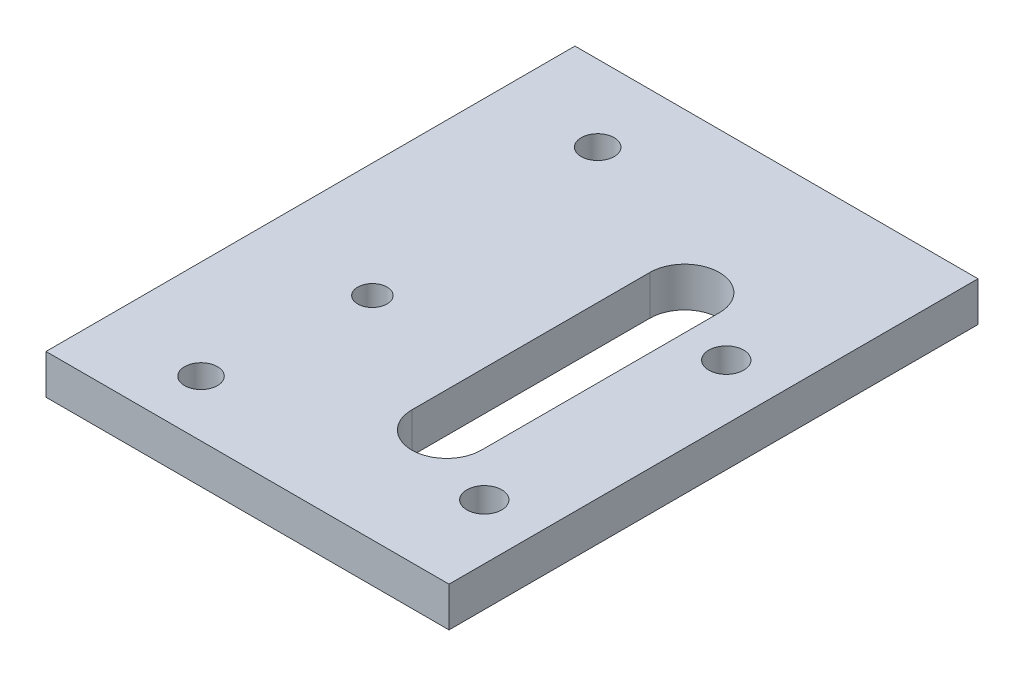
ISO-10303-21;
HEADER;
FILE_DESCRIPTION(('STEP AP214'),'2;1');
FILE_NAME('part.step','',(''),(''),'','','');
FILE_SCHEMA(('AUTOMOTIVE_DESIGN { 1 0 10303 214 1 1 1 1 }'));
ENDSEC;
DATA;
#1=APPLICATION_CONTEXT('core data for automotive mechanical design processes');
#2=APPLICATION_PROTOCOL_DEFINITION('international standard','automotive_design',2000,#1);
#3=PRODUCT_CONTEXT('',#1,'mechanical');
#4=PRODUCT('Part','Part','',(#3));
#5=PRODUCT_RELATED_PRODUCT_CATEGORY('part','',(#4));
#6=PRODUCT_DEFINITION_FORMATION('','',#4);
#7=PRODUCT_DEFINITION_CONTEXT('part definition',#1,'design');
#8=PRODUCT_DEFINITION('design','',#6,#7);
#9=PRODUCT_DEFINITION_SHAPE('','',#8);
#10=(LENGTH_UNIT() NAMED_UNIT(*) SI_UNIT(.MILLI.,.METRE.));
#11=(NAMED_UNIT(*) PLANE_ANGLE_UNIT() SI_UNIT($,.RADIAN.));
#12=(NAMED_UNIT(*) SI_UNIT($,.STERADIAN.) SOLID_ANGLE_UNIT());
#13=UNCERTAINTY_MEASURE_WITH_UNIT(LENGTH_MEASURE(1.E-05),#10,'distance_accuracy_value','');
#14=(GEOMETRIC_REPRESENTATION_CONTEXT(3) GLOBAL_UNCERTAINTY_ASSIGNED_CONTEXT((#13)) GLOBAL_UNIT_ASSIGNED_CONTEXT((#10,
#11,#12)) REPRESENTATION_CONTEXT('',''));
#15=CARTESIAN_POINT('',(0.,0.,0.));
#16=DIRECTION('',(0.,0.,1.));
#17=DIRECTION('',(1.,0.,0.));
#18=AXIS2_PLACEMENT_3D('',#15,#16,#17);
#19=CARTESIAN_POINT('',(0.,5.,0.));
#20=DIRECTION('',(1.,0.,0.));
#21=DIRECTION('',(0.,0.,-1.));
#22=AXIS2_PLACEMENT_3D('',#19,#20,#21);
#23=PLANE('',#22);
#24=DIRECTION('',(0.,0.,1.));
#25=VECTOR('',#24,1.);
#26=CARTESIAN_POINT('',(0.,0.,0.));
#27=LINE('',#26,#25);
#28=CARTESIAN_POINT('',(0.,0.,-66.675));
#29=VERTEX_POINT('',#28);
#30=CARTESIAN_POINT('',(0.,0.,0.));
#31=VERTEX_POINT('',#30);
#32=EDGE_CURVE('E158',#29,#31,#27,.T.);
#33=ORIENTED_EDGE('',*,*,#32,.T.);
#34=DIRECTION('',(0.,-1.,0.));
#35=VECTOR('',#34,1.);
#36=CARTESIAN_POINT('',(0.,5.,0.));
#37=LINE('',#36,#35);
#38=CARTESIAN_POINT('',(0.,5.,0.));
#39=VERTEX_POINT('',#38);
#40=EDGE_CURVE('E11',#39,#31,#37,.T.);
#41=ORIENTED_EDGE('',*,*,#40,.F.);
#42=DIRECTION('',(0.,0.,1.));
#43=VECTOR('',#42,1.);
#44=CARTESIAN_POINT('',(0.,5.,0.));
#45=LINE('',#44,#43);
#46=CARTESIAN_POINT('',(0.,5.,-66.675));
#47=VERTEX_POINT('',#46);
#48=EDGE_CURVE('E161',#47,#39,#45,.T.);
#49=ORIENTED_EDGE('',*,*,#48,.F.);
#50=DIRECTION('',(0.,-1.,0.));
#51=VECTOR('',#50,1.);
#52=CARTESIAN_POINT('',(0.,5.,-66.675));
#53=LINE('',#52,#51);
#54=EDGE_CURVE('E171',#47,#29,#53,.T.);
#55=ORIENTED_EDGE('',*,*,#54,.T.);
#56=EDGE_LOOP('',(#33,#41,#49,#55));
#57=FACE_BOUND('',#56,.T.);
#58=ADVANCED_FACE('F32',(#57),#23,.F.);
#59=CARTESIAN_POINT('',(0.,5.,0.));
#60=DIRECTION('',(0.,0.,-1.));
#61=DIRECTION('',(-1.,0.,0.));
#62=AXIS2_PLACEMENT_3D('',#59,#60,#61);
#63=PLANE('',#62);
#64=DIRECTION('',(1.,0.,0.));
#65=VECTOR('',#64,1.);
#66=CARTESIAN_POINT('',(0.,0.,0.));
#67=LINE('',#66,#65);
#68=CARTESIAN_POINT('',(50.8,0.,0.));
#69=VERTEX_POINT('',#68);
#70=EDGE_CURVE('E174',#31,#69,#67,.T.);
#71=ORIENTED_EDGE('',*,*,#70,.T.);
#72=DIRECTION('',(0.,-1.,0.));
#73=VECTOR('',#72,1.);
#74=CARTESIAN_POINT('',(50.8,5.,0.));
#75=LINE('',#74,#73);
#76=CARTESIAN_POINT('',(50.8,5.,0.));
#77=VERTEX_POINT('',#76);
#78=EDGE_CURVE('E39',#77,#69,#75,.T.);
#79=ORIENTED_EDGE('',*,*,#78,.F.);
#80=DIRECTION('',(1.,0.,0.));
#81=VECTOR('',#80,1.);
#82=CARTESIAN_POINT('',(0.,5.,0.));
#83=LINE('',#82,#81);
#84=EDGE_CURVE('E164',#39,#77,#83,.T.);
#85=ORIENTED_EDGE('',*,*,#84,.F.);
#86=ORIENTED_EDGE('',*,*,#40,.T.);
#87=EDGE_LOOP('',(#71,#79,#85,#86));
#88=FACE_BOUND('',#87,.T.);
#89=ADVANCED_FACE('F203',(#88),#63,.F.);
#90=CARTESIAN_POINT('',(50.8,5.,0.));
#91=DIRECTION('',(-1.,0.,0.));
#92=DIRECTION('',(0.,0.,1.));
#93=AXIS2_PLACEMENT_3D('',#90,#91,#92);
#94=PLANE('',#93);
#95=DIRECTION('',(0.,0.,-1.));
#96=VECTOR('',#95,1.);
#97=CARTESIAN_POINT('',(50.8,0.,0.));
#98=LINE('',#97,#96);
#99=CARTESIAN_POINT('',(50.8,0.,-66.675));
#100=VERTEX_POINT('',#99);
#101=EDGE_CURVE('E176',#69,#100,#98,.T.);
#102=ORIENTED_EDGE('',*,*,#101,.T.);
#103=DIRECTION('',(0.,-1.,0.));
#104=VECTOR('',#103,1.);
#105=CARTESIAN_POINT('',(50.8,5.,-66.675));
#106=LINE('',#105,#104);
#107=CARTESIAN_POINT('',(50.8,5.,-66.675));
#108=VERTEX_POINT('',#107);
#109=EDGE_CURVE('E181',#108,#100,#106,.T.);
#110=ORIENTED_EDGE('',*,*,#109,.F.);
#111=DIRECTION('',(0.,0.,-1.));
#112=VECTOR('',#111,1.);
#113=CARTESIAN_POINT('',(50.8,5.,0.));
#114=LINE('',#113,#112);
#115=EDGE_CURVE('E167',#77,#108,#114,.T.);
#116=ORIENTED_EDGE('',*,*,#115,.F.);
#117=ORIENTED_EDGE('',*,*,#78,.T.);
#118=EDGE_LOOP('',(#102,#110,#116,#117));
#119=FACE_BOUND('',#118,.T.);
#120=ADVANCED_FACE('F188',(#119),#94,.F.);
#121=CARTESIAN_POINT('',(0.,5.,-66.675));
#122=DIRECTION('',(0.,0.,1.));
#123=DIRECTION('',(1.,0.,0.));
#124=AXIS2_PLACEMENT_3D('',#121,#122,#123);
#125=PLANE('',#124);
#126=DIRECTION('',(-1.,0.,0.));
#127=VECTOR('',#126,1.);
#128=CARTESIAN_POINT('',(0.,0.,-66.675));
#129=LINE('',#128,#127);
#130=EDGE_CURVE('E165',#100,#29,#129,.T.);
#131=ORIENTED_EDGE('',*,*,#130,.T.);
#132=ORIENTED_EDGE('',*,*,#54,.F.);
#133=DIRECTION('',(-1.,0.,0.));
#134=VECTOR('',#133,1.);
#135=CARTESIAN_POINT('',(0.,5.,-66.675));
#136=LINE('',#135,#134);
#137=EDGE_CURVE('E169',#108,#47,#136,.T.);
#138=ORIENTED_EDGE('',*,*,#137,.F.);
#139=ORIENTED_EDGE('',*,*,#109,.T.);
#140=EDGE_LOOP('',(#131,#132,#138,#139));
#141=FACE_BOUND('',#140,.T.);
#142=ADVANCED_FACE('F196',(#141),#125,.F.);
#143=CARTESIAN_POINT('',(0.,5.,0.));
#144=DIRECTION('',(0.,-1.,0.));
#145=DIRECTION('',(0.,0.,-1.));
#146=AXIS2_PLACEMENT_3D('',#143,#144,#145);
#147=PLANE('',#146);
#148=DIRECTION('',(0.,0.,1.));
#149=VECTOR('',#148,1.);
#150=CARTESIAN_POINT('',(29.4299999999999,5.,-46.675));
#151=LINE('',#150,#149);
#152=CARTESIAN_POINT('',(29.4299999999999,5.,-46.675));
#153=VERTEX_POINT('',#152);
#154=CARTESIAN_POINT('',(29.4299999999999,5.,-16.675));
#155=VERTEX_POINT('',#154);
#156=EDGE_CURVE('E115',#153,#155,#151,.T.);
#157=ORIENTED_EDGE('',*,*,#156,.F.);
#158=CARTESIAN_POINT('',(33.82,5.,-46.675));
#159=DIRECTION('',(0.,1.,0.));
#160=DIRECTION('',(0.,0.,1.));
#161=AXIS2_PLACEMENT_3D('',#158,#159,#160);
#162=CIRCLE('',#161,4.39000000000003);
#163=CARTESIAN_POINT('',(38.21,5.,-46.675));
#164=VERTEX_POINT('',#163);
#165=EDGE_CURVE('E46',#164,#153,#162,.T.);
#166=ORIENTED_EDGE('',*,*,#165,.F.);
#167=DIRECTION('',(0.,0.,-1.));
#168=VECTOR('',#167,1.);
#169=CARTESIAN_POINT('',(38.21,5.,-46.675));
#170=LINE('',#169,#168);
#171=CARTESIAN_POINT('',(38.21,5.,-16.675));
#172=VERTEX_POINT('',#171);
#173=EDGE_CURVE('E108',#172,#164,#170,.T.);
#174=ORIENTED_EDGE('',*,*,#173,.F.);
#175=CARTESIAN_POINT('',(33.82,5.,-16.675));
#176=DIRECTION('',(0.,1.,0.));
#177=DIRECTION('',(0.,0.,1.));
#178=AXIS2_PLACEMENT_3D('',#175,#176,#177);
#179=CIRCLE('',#178,4.39000000000004);
#180=EDGE_CURVE('E122',#155,#172,#179,.T.);
#181=ORIENTED_EDGE('',*,*,#180,.F.);
#182=EDGE_LOOP('',(#157,#166,#174,#181));
#183=FACE_BOUND('',#182,.T.);
#184=CARTESIAN_POINT('',(43.82,5.,-11.425));
#185=DIRECTION('',(0.,1.,0.));
#186=DIRECTION('',(0.,0.,1.));
#187=AXIS2_PLACEMENT_3D('',#184,#185,#186);
#188=CIRCLE('',#187,2.2);
#189=CARTESIAN_POINT('',(43.82,5.,-9.225));
#190=VERTEX_POINT('',#189);
#191=EDGE_CURVE('E131',#190,#190,#188,.T.);
#192=ORIENTED_EDGE('',*,*,#191,.F.);
#193=EDGE_LOOP('',(#192));
#194=FACE_BOUND('',#193,.T.);
#195=CARTESIAN_POINT('',(43.82,5.,-41.925));
#196=DIRECTION('',(0.,1.,0.));
#197=DIRECTION('',(0.,0.,1.));
#198=AXIS2_PLACEMENT_3D('',#195,#196,#197);
#199=CIRCLE('',#198,2.20000000000001);
#200=CARTESIAN_POINT('',(43.82,5.,-39.725));
#201=VERTEX_POINT('',#200);
#202=EDGE_CURVE('E137',#201,#201,#199,.T.);
#203=ORIENTED_EDGE('',*,*,#202,.F.);
#204=EDGE_LOOP('',(#203));
#205=FACE_BOUND('',#204,.T.);
#206=CARTESIAN_POINT('',(14.465,5.,-26.675));
#207=DIRECTION('',(0.,1.,0.));
#208=DIRECTION('',(0.,0.,1.));
#209=AXIS2_PLACEMENT_3D('',#206,#207,#208);
#210=CIRCLE('',#209,1.85);
#211=CARTESIAN_POINT('',(14.465,5.,-24.825));
#212=VERTEX_POINT('',#211);
#213=EDGE_CURVE('E140',#212,#212,#210,.T.);
#214=ORIENTED_EDGE('',*,*,#213,.F.);
#215=EDGE_LOOP('',(#214));
#216=FACE_BOUND('',#215,.T.);
#217=CARTESIAN_POINT('',(12.465,5.,-7.075));
#218=DIRECTION('',(0.,1.,0.));
#219=DIRECTION('',(0.,0.,1.));
#220=AXIS2_PLACEMENT_3D('',#217,#218,#219);
#221=CIRCLE('',#220,2.075);
#222=CARTESIAN_POINT('',(12.465,5.,-5.));
#223=VERTEX_POINT('',#222);
#224=EDGE_CURVE('E146',#223,#223,#221,.T.);
#225=ORIENTED_EDGE('',*,*,#224,.F.);
#226=EDGE_LOOP('',(#225));
#227=FACE_BOUND('',#226,.T.);
#228=CARTESIAN_POINT('',(12.465,5.,-57.075));
#229=DIRECTION('',(0.,1.,0.));
#230=DIRECTION('',(0.,0.,1.));
#231=AXIS2_PLACEMENT_3D('',#228,#229,#230);
#232=CIRCLE('',#231,2.07499999999999);
#233=CARTESIAN_POINT('',(12.465,5.,-55.));
#234=VERTEX_POINT('',#233);
#235=EDGE_CURVE('E152',#234,#234,#232,.T.);
#236=ORIENTED_EDGE('',*,*,#235,.F.);
#237=EDGE_LOOP('',(#236));
#238=FACE_BOUND('',#237,.T.);
#239=ORIENTED_EDGE('',*,*,#48,.T.);
#240=ORIENTED_EDGE('',*,*,#84,.T.);
#241=ORIENTED_EDGE('',*,*,#115,.T.);
#242=ORIENTED_EDGE('',*,*,#137,.T.);
#243=EDGE_LOOP('',(#239,#240,#241,#242));
#244=FACE_BOUND('',#243,.T.);
#245=ADVANCED_FACE('F202',(#183,#194,#205,#216,#227,#238,#244),#147,.F.);
#246=CARTESIAN_POINT('',(0.,0.,0.));
#247=DIRECTION('',(0.,-1.,0.));
#248=DIRECTION('',(0.,0.,-1.));
#249=AXIS2_PLACEMENT_3D('',#246,#247,#248);
#250=PLANE('',#249);
#251=CARTESIAN_POINT('',(33.82,0.,-46.675));
#252=DIRECTION('',(0.,-1.,0.));
#253=DIRECTION('',(0.,0.,-1.));
#254=AXIS2_PLACEMENT_3D('',#251,#252,#253);
#255=CIRCLE('',#254,4.39000000000003);
#256=CARTESIAN_POINT('',(38.21,0.,-46.675));
#257=VERTEX_POINT('',#256);
#258=CARTESIAN_POINT('',(29.4299999999999,0.,-46.675));
#259=VERTEX_POINT('',#258);
#260=EDGE_CURVE('E106',#257,#259,#255,.F.);
#261=ORIENTED_EDGE('',*,*,#260,.T.);
#262=DIRECTION('',(0.,0.,1.));
#263=VECTOR('',#262,1.);
#264=CARTESIAN_POINT('',(29.4299999999999,0.,-46.675));
#265=LINE('',#264,#263);
#266=CARTESIAN_POINT('',(29.4299999999999,0.,-16.675));
#267=VERTEX_POINT('',#266);
#268=EDGE_CURVE('E95',#259,#267,#265,.T.);
#269=ORIENTED_EDGE('',*,*,#268,.T.);
#270=CARTESIAN_POINT('',(33.82,0.,-16.675));
#271=DIRECTION('',(0.,-1.,0.));
#272=DIRECTION('',(0.,0.,-1.));
#273=AXIS2_PLACEMENT_3D('',#270,#271,#272);
#274=CIRCLE('',#273,4.39000000000004);
#275=CARTESIAN_POINT('',(38.21,0.,-16.675));
#276=VERTEX_POINT('',#275);
#277=EDGE_CURVE('E117',#267,#276,#274,.F.);
#278=ORIENTED_EDGE('',*,*,#277,.T.);
#279=DIRECTION('',(0.,0.,-1.));
#280=VECTOR('',#279,1.);
#281=CARTESIAN_POINT('',(38.21,0.,-46.675));
#282=LINE('',#281,#280);
#283=EDGE_CURVE('E113',#276,#257,#282,.T.);
#284=ORIENTED_EDGE('',*,*,#283,.T.);
#285=EDGE_LOOP('',(#261,#269,#278,#284));
#286=FACE_BOUND('',#285,.T.);
#287=CARTESIAN_POINT('',(43.82,0.,-11.425));
#288=DIRECTION('',(0.,-1.,0.));
#289=DIRECTION('',(0.,0.,-1.));
#290=AXIS2_PLACEMENT_3D('',#287,#288,#289);
#291=CIRCLE('',#290,2.2);
#292=CARTESIAN_POINT('',(43.82,0.,-13.625));
#293=VERTEX_POINT('',#292);
#294=EDGE_CURVE('E102',#293,#293,#291,.F.);
#295=ORIENTED_EDGE('',*,*,#294,.T.);
#296=EDGE_LOOP('',(#295));
#297=FACE_BOUND('',#296,.T.);
#298=CARTESIAN_POINT('',(43.82,0.,-41.925));
#299=DIRECTION('',(0.,-1.,0.));
#300=DIRECTION('',(0.,0.,-1.));
#301=AXIS2_PLACEMENT_3D('',#298,#299,#300);
#302=CIRCLE('',#301,2.20000000000001);
#303=CARTESIAN_POINT('',(43.82,0.,-44.125));
#304=VERTEX_POINT('',#303);
#305=EDGE_CURVE('E134',#304,#304,#302,.F.);
#306=ORIENTED_EDGE('',*,*,#305,.T.);
#307=EDGE_LOOP('',(#306));
#308=FACE_BOUND('',#307,.T.);
#309=CARTESIAN_POINT('',(14.465,0.,-26.675));
#310=DIRECTION('',(0.,1.,0.));
#311=DIRECTION('',(0.,0.,1.));
#312=AXIS2_PLACEMENT_3D('',#309,#310,#311);
#313=CIRCLE('',#312,1.85);
#314=CARTESIAN_POINT('',(14.465,0.,-24.825));
#315=VERTEX_POINT('',#314);
#316=EDGE_CURVE('E143',#315,#315,#313,.T.);
#317=ORIENTED_EDGE('',*,*,#316,.T.);
#318=EDGE_LOOP('',(#317));
#319=FACE_BOUND('',#318,.T.);
#320=CARTESIAN_POINT('',(12.465,0.,-7.075));
#321=DIRECTION('',(0.,1.,0.));
#322=DIRECTION('',(0.,0.,1.));
#323=AXIS2_PLACEMENT_3D('',#320,#321,#322);
#324=CIRCLE('',#323,2.075);
#325=CARTESIAN_POINT('',(12.465,0.,-5.));
#326=VERTEX_POINT('',#325);
#327=EDGE_CURVE('E149',#326,#326,#324,.T.);
#328=ORIENTED_EDGE('',*,*,#327,.T.);
#329=EDGE_LOOP('',(#328));
#330=FACE_BOUND('',#329,.T.);
#331=CARTESIAN_POINT('',(12.465,0.,-57.075));
#332=DIRECTION('',(0.,1.,0.));
#333=DIRECTION('',(0.,0.,1.));
#334=AXIS2_PLACEMENT_3D('',#331,#332,#333);
#335=CIRCLE('',#334,2.07499999999999);
#336=CARTESIAN_POINT('',(12.465,0.,-55.));
#337=VERTEX_POINT('',#336);
#338=EDGE_CURVE('E155',#337,#337,#335,.T.);
#339=ORIENTED_EDGE('',*,*,#338,.T.);
#340=EDGE_LOOP('',(#339));
#341=FACE_BOUND('',#340,.T.);
#342=ORIENTED_EDGE('',*,*,#32,.F.);
#343=ORIENTED_EDGE('',*,*,#130,.F.);
#344=ORIENTED_EDGE('',*,*,#101,.F.);
#345=ORIENTED_EDGE('',*,*,#70,.F.);
#346=EDGE_LOOP('',(#342,#343,#344,#345));
#347=FACE_BOUND('',#346,.T.);
#348=ADVANCED_FACE('F111',(#286,#297,#308,#319,#330,#341,#347),#250,.T.);
#349=CARTESIAN_POINT('',(12.465,0.,-57.075));
#350=DIRECTION('',(0.,1.,0.));
#351=DIRECTION('',(0.,0.,1.));
#352=AXIS2_PLACEMENT_3D('',#349,#350,#351);
#353=CYLINDRICAL_SURFACE('',#352,2.07499999999999);
#354=ORIENTED_EDGE('',*,*,#338,.F.);
#355=EDGE_LOOP('',(#354));
#356=FACE_BOUND('',#355,.T.);
#357=ORIENTED_EDGE('',*,*,#235,.T.);
#358=EDGE_LOOP('',(#357));
#359=FACE_BOUND('',#358,.T.);
#360=ADVANCED_FACE('F215',(#356,#359),#353,.F.);
#361=CARTESIAN_POINT('',(12.465,0.,-7.075));
#362=DIRECTION('',(0.,1.,0.));
#363=DIRECTION('',(0.,0.,1.));
#364=AXIS2_PLACEMENT_3D('',#361,#362,#363);
#365=CYLINDRICAL_SURFACE('',#364,2.075);
#366=ORIENTED_EDGE('',*,*,#327,.F.);
#367=EDGE_LOOP('',(#366));
#368=FACE_BOUND('',#367,.T.);
#369=ORIENTED_EDGE('',*,*,#224,.T.);
#370=EDGE_LOOP('',(#369));
#371=FACE_BOUND('',#370,.T.);
#372=ADVANCED_FACE('F221',(#368,#371),#365,.F.);
#373=CARTESIAN_POINT('',(14.465,0.,-26.675));
#374=DIRECTION('',(0.,1.,0.));
#375=DIRECTION('',(0.,0.,1.));
#376=AXIS2_PLACEMENT_3D('',#373,#374,#375);
#377=CYLINDRICAL_SURFACE('',#376,1.85);
#378=ORIENTED_EDGE('',*,*,#316,.F.);
#379=EDGE_LOOP('',(#378));
#380=FACE_BOUND('',#379,.T.);
#381=ORIENTED_EDGE('',*,*,#213,.T.);
#382=EDGE_LOOP('',(#381));
#383=FACE_BOUND('',#382,.T.);
#384=ADVANCED_FACE('F225',(#380,#383),#377,.F.);
#385=CARTESIAN_POINT('',(43.82,-0.00100000000000013,-41.925));
#386=DIRECTION('',(0.,1.,0.));
#387=DIRECTION('',(0.,0.,1.));
#388=AXIS2_PLACEMENT_3D('',#385,#386,#387);
#389=CYLINDRICAL_SURFACE('',#388,2.20000000000001);
#390=ORIENTED_EDGE('',*,*,#305,.F.);
#391=EDGE_LOOP('',(#390));
#392=FACE_BOUND('',#391,.T.);
#393=ORIENTED_EDGE('',*,*,#202,.T.);
#394=EDGE_LOOP('',(#393));
#395=FACE_BOUND('',#394,.T.);
#396=ADVANCED_FACE('F229',(#392,#395),#389,.F.);
#397=CARTESIAN_POINT('',(43.82,-0.00100000000000013,-11.425));
#398=DIRECTION('',(0.,1.,0.));
#399=DIRECTION('',(0.,0.,1.));
#400=AXIS2_PLACEMENT_3D('',#397,#398,#399);
#401=CYLINDRICAL_SURFACE('',#400,2.2);
#402=ORIENTED_EDGE('',*,*,#294,.F.);
#403=EDGE_LOOP('',(#402));
#404=FACE_BOUND('',#403,.T.);
#405=ORIENTED_EDGE('',*,*,#191,.T.);
#406=EDGE_LOOP('',(#405));
#407=FACE_BOUND('',#406,.T.);
#408=ADVANCED_FACE('F233',(#404,#407),#401,.F.);
#409=CARTESIAN_POINT('',(33.82,-0.00100000000000013,-46.675));
#410=DIRECTION('',(0.,1.,0.));
#411=DIRECTION('',(0.,0.,1.));
#412=AXIS2_PLACEMENT_3D('',#409,#410,#411);
#413=CYLINDRICAL_SURFACE('',#412,4.39000000000003);
#414=DIRECTION('',(0.,1.,0.));
#415=VECTOR('',#414,1.);
#416=CARTESIAN_POINT('',(38.21,-0.00100000000000013,-46.675));
#417=LINE('',#416,#415);
#418=EDGE_CURVE('E103',#257,#164,#417,.T.);
#419=ORIENTED_EDGE('',*,*,#418,.T.);
#420=ORIENTED_EDGE('',*,*,#165,.T.);
#421=DIRECTION('',(0.,1.,0.));
#422=VECTOR('',#421,1.);
#423=CARTESIAN_POINT('',(29.4299999999999,-0.00100000000000013,-46.675));
#424=LINE('',#423,#422);
#425=EDGE_CURVE('E97',#259,#153,#424,.T.);
#426=ORIENTED_EDGE('',*,*,#425,.F.);
#427=ORIENTED_EDGE('',*,*,#260,.F.);
#428=EDGE_LOOP('',(#419,#420,#426,#427));
#429=FACE_BOUND('',#428,.T.);
#430=ADVANCED_FACE('F105',(#429),#413,.F.);
#431=CARTESIAN_POINT('',(38.21,-0.00100000000000013,-46.675));
#432=DIRECTION('',(1.,0.,0.));
#433=DIRECTION('',(0.,0.,-1.));
#434=AXIS2_PLACEMENT_3D('',#431,#432,#433);
#435=PLANE('',#434);
#436=DIRECTION('',(0.,1.,0.));
#437=VECTOR('',#436,1.);
#438=CARTESIAN_POINT('',(38.21,-0.00100000000000013,-16.675));
#439=LINE('',#438,#437);
#440=EDGE_CURVE('E128',#276,#172,#439,.T.);
#441=ORIENTED_EDGE('',*,*,#440,.T.);
#442=ORIENTED_EDGE('',*,*,#173,.T.);
#443=ORIENTED_EDGE('',*,*,#418,.F.);
#444=ORIENTED_EDGE('',*,*,#283,.F.);
#445=EDGE_LOOP('',(#441,#442,#443,#444));
#446=FACE_BOUND('',#445,.T.);
#447=ADVANCED_FACE('F240',(#446),#435,.F.);
#448=CARTESIAN_POINT('',(33.82,-0.00100000000000013,-16.675));
#449=DIRECTION('',(0.,1.,0.));
#450=DIRECTION('',(0.,0.,1.));
#451=AXIS2_PLACEMENT_3D('',#448,#449,#450);
#452=CYLINDRICAL_SURFACE('',#451,4.39000000000004);
#453=DIRECTION('',(0.,1.,0.));
#454=VECTOR('',#453,1.);
#455=CARTESIAN_POINT('',(29.4299999999999,-0.00100000000000013,-16.675));
#456=LINE('',#455,#454);
#457=EDGE_CURVE('E54',#267,#155,#456,.T.);
#458=ORIENTED_EDGE('',*,*,#457,.T.);
#459=ORIENTED_EDGE('',*,*,#180,.T.);
#460=ORIENTED_EDGE('',*,*,#440,.F.);
#461=ORIENTED_EDGE('',*,*,#277,.F.);
#462=EDGE_LOOP('',(#458,#459,#460,#461));
#463=FACE_BOUND('',#462,.T.);
#464=ADVANCED_FACE('F243',(#463),#452,.F.);
#465=CARTESIAN_POINT('',(29.4299999999999,-0.00100000000000013,-46.675));
#466=DIRECTION('',(-1.,0.,0.));
#467=DIRECTION('',(0.,0.,1.));
#468=AXIS2_PLACEMENT_3D('',#465,#466,#467);
#469=PLANE('',#468);
#470=ORIENTED_EDGE('',*,*,#425,.T.);
#471=ORIENTED_EDGE('',*,*,#156,.T.);
#472=ORIENTED_EDGE('',*,*,#457,.F.);
#473=ORIENTED_EDGE('',*,*,#268,.F.);
#474=EDGE_LOOP('',(#470,#471,#472,#473));
#475=FACE_BOUND('',#474,.T.);
#476=ADVANCED_FACE('F96',(#475),#469,.F.);
#477=CLOSED_SHELL('',(#58,#89,#120,#142,#245,#348,#360,#372,#384,#396,#408,#430,#447,#464,#476));
#478=MANIFOLD_SOLID_BREP('B2',#477);
#479=ADVANCED_BREP_SHAPE_REPRESENTATION('',(#18,#478),#14);
#480=SHAPE_DEFINITION_REPRESENTATION(#9,#479);
ENDSEC;
END-ISO-10303-21;
